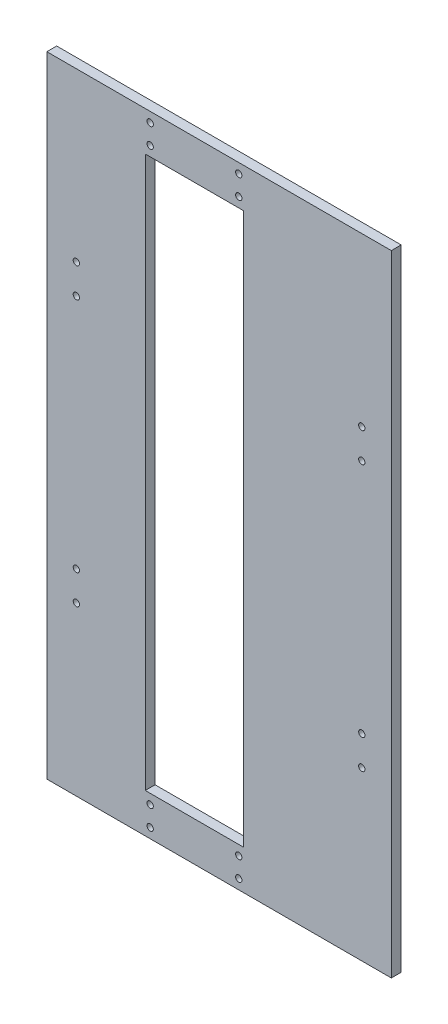
ISO-10303-21;
HEADER;
FILE_DESCRIPTION(('STEP AP214'),'2;1');
FILE_NAME('part.step','',(''),(''),'','','');
FILE_SCHEMA(('AUTOMOTIVE_DESIGN { 1 0 10303 214 1 1 1 1 }'));
ENDSEC;
DATA;
#1=APPLICATION_CONTEXT('core data for automotive mechanical design processes');
#2=APPLICATION_PROTOCOL_DEFINITION('international standard','automotive_design',2000,#1);
#3=PRODUCT_CONTEXT('',#1,'mechanical');
#4=PRODUCT('Part','Part','',(#3));
#5=PRODUCT_RELATED_PRODUCT_CATEGORY('part','',(#4));
#6=PRODUCT_DEFINITION_FORMATION('','',#4);
#7=PRODUCT_DEFINITION_CONTEXT('part definition',#1,'design');
#8=PRODUCT_DEFINITION('design','',#6,#7);
#9=PRODUCT_DEFINITION_SHAPE('','',#8);
#10=(LENGTH_UNIT() NAMED_UNIT(*) SI_UNIT(.MILLI.,.METRE.));
#11=(NAMED_UNIT(*) PLANE_ANGLE_UNIT() SI_UNIT($,.RADIAN.));
#12=(NAMED_UNIT(*) SI_UNIT($,.STERADIAN.) SOLID_ANGLE_UNIT());
#13=UNCERTAINTY_MEASURE_WITH_UNIT(LENGTH_MEASURE(1.E-05),#10,'distance_accuracy_value','');
#14=(GEOMETRIC_REPRESENTATION_CONTEXT(3) GLOBAL_UNCERTAINTY_ASSIGNED_CONTEXT((#13)) GLOBAL_UNIT_ASSIGNED_CONTEXT((#10,
#11,#12)) REPRESENTATION_CONTEXT('',''));
#15=CARTESIAN_POINT('',(0.,0.,0.));
#16=DIRECTION('',(0.,0.,1.));
#17=DIRECTION('',(1.,0.,0.));
#18=AXIS2_PLACEMENT_3D('',#15,#16,#17);
#19=CARTESIAN_POINT('',(0.,0.,5.));
#20=DIRECTION('',(0.,0.,-1.));
#21=DIRECTION('',(-1.,0.,0.));
#22=AXIS2_PLACEMENT_3D('',#19,#20,#21);
#23=PLANE('',#22);
#24=CARTESIAN_POINT('',(-60.,60.,5.));
#25=DIRECTION('',(0.,0.,1.));
#26=DIRECTION('',(1.,0.,0.));
#27=AXIS2_PLACEMENT_3D('',#24,#25,#26);
#28=CIRCLE('',#27,1.6);
#29=CARTESIAN_POINT('',(-58.4,60.,5.));
#30=VERTEX_POINT('',#29);
#31=EDGE_CURVE('E513',#30,#30,#28,.T.);
#32=ORIENTED_EDGE('',*,*,#31,.F.);
#33=EDGE_LOOP('',(#32));
#34=FACE_BOUND('',#33,.T.);
#35=CARTESIAN_POINT('',(-59.9999999999998,-60.,5.));
#36=DIRECTION('',(0.,0.,1.));
#37=DIRECTION('',(-1.,0.,0.));
#38=AXIS2_PLACEMENT_3D('',#35,#36,#37);
#39=CIRCLE('',#38,1.6);
#40=CARTESIAN_POINT('',(-61.5999999999998,-60.,5.));
#41=VERTEX_POINT('',#40);
#42=EDGE_CURVE('E516',#41,#41,#39,.T.);
#43=ORIENTED_EDGE('',*,*,#42,.F.);
#44=EDGE_LOOP('',(#43));
#45=FACE_BOUND('',#44,.T.);
#46=CARTESIAN_POINT('',(-59.9999999999998,-75.,5.));
#47=DIRECTION('',(0.,0.,1.));
#48=DIRECTION('',(-1.,0.,0.));
#49=AXIS2_PLACEMENT_3D('',#46,#47,#48);
#50=CIRCLE('',#49,1.6);
#51=CARTESIAN_POINT('',(-61.5999999999997,-75.,5.));
#52=VERTEX_POINT('',#51);
#53=EDGE_CURVE('E527',#52,#52,#50,.T.);
#54=ORIENTED_EDGE('',*,*,#53,.F.);
#55=EDGE_LOOP('',(#54));
#56=FACE_BOUND('',#55,.T.);
#57=CARTESIAN_POINT('',(84.9999999999997,-75.,5.));
#58=DIRECTION('',(0.,0.,1.));
#59=DIRECTION('',(1.,0.,0.));
#60=AXIS2_PLACEMENT_3D('',#57,#58,#59);
#61=CIRCLE('',#60,1.60000000000002);
#62=CARTESIAN_POINT('',(86.5999999999998,-75.,5.));
#63=VERTEX_POINT('',#62);
#64=EDGE_CURVE('E533',#63,#63,#61,.T.);
#65=ORIENTED_EDGE('',*,*,#64,.F.);
#66=EDGE_LOOP('',(#65));
#67=FACE_BOUND('',#66,.T.);
#68=CARTESIAN_POINT('',(84.9999999999998,-60.,5.));
#69=DIRECTION('',(0.,0.,1.));
#70=DIRECTION('',(1.,0.,0.));
#71=AXIS2_PLACEMENT_3D('',#68,#69,#70);
#72=CIRCLE('',#71,1.60000000000002);
#73=CARTESIAN_POINT('',(86.5999999999998,-60.,5.));
#74=VERTEX_POINT('',#73);
#75=EDGE_CURVE('E538',#74,#74,#72,.T.);
#76=ORIENTED_EDGE('',*,*,#75,.F.);
#77=EDGE_LOOP('',(#76));
#78=FACE_BOUND('',#77,.T.);
#79=CARTESIAN_POINT('',(85.,60.,5.));
#80=DIRECTION('',(0.,0.,1.));
#81=DIRECTION('',(-1.,0.,0.));
#82=AXIS2_PLACEMENT_3D('',#79,#80,#81);
#83=CIRCLE('',#82,1.60000000000002);
#84=CARTESIAN_POINT('',(83.4,60.,5.));
#85=VERTEX_POINT('',#84);
#86=EDGE_CURVE('E583',#85,#85,#83,.T.);
#87=ORIENTED_EDGE('',*,*,#86,.F.);
#88=EDGE_LOOP('',(#87));
#89=FACE_BOUND('',#88,.T.);
#90=CARTESIAN_POINT('',(85.,75.,5.));
#91=DIRECTION('',(0.,0.,1.));
#92=DIRECTION('',(-1.,0.,0.));
#93=AXIS2_PLACEMENT_3D('',#90,#91,#92);
#94=CIRCLE('',#93,1.60000000000002);
#95=CARTESIAN_POINT('',(83.4,75.,5.));
#96=VERTEX_POINT('',#95);
#97=EDGE_CURVE('E590',#96,#96,#94,.T.);
#98=ORIENTED_EDGE('',*,*,#97,.F.);
#99=EDGE_LOOP('',(#98));
#100=FACE_BOUND('',#99,.T.);
#101=CARTESIAN_POINT('',(-60.,75.,5.));
#102=DIRECTION('',(0.,0.,1.));
#103=DIRECTION('',(1.,0.,0.));
#104=AXIS2_PLACEMENT_3D('',#101,#102,#103);
#105=CIRCLE('',#104,1.6);
#106=CARTESIAN_POINT('',(-58.4,75.,5.));
#107=VERTEX_POINT('',#106);
#108=EDGE_CURVE('E127',#107,#107,#105,.T.);
#109=ORIENTED_EDGE('',*,*,#108,.F.);
#110=EDGE_LOOP('',(#109));
#111=FACE_BOUND('',#110,.T.);
#112=CARTESIAN_POINT('',(-22.4999999999968,-155.,5.));
#113=DIRECTION('',(0.,0.,1.));
#114=DIRECTION('',(1.,0.,0.));
#115=AXIS2_PLACEMENT_3D('',#112,#113,#114);
#116=CIRCLE('',#115,1.6);
#117=CARTESIAN_POINT('',(-20.8999999999968,-155.,5.));
#118=VERTEX_POINT('',#117);
#119=EDGE_CURVE('E167',#118,#118,#116,.T.);
#120=ORIENTED_EDGE('',*,*,#119,.F.);
#121=EDGE_LOOP('',(#120));
#122=FACE_BOUND('',#121,.T.);
#123=CARTESIAN_POINT('',(22.5000000000032,-155.,5.));
#124=DIRECTION('',(0.,0.,1.));
#125=DIRECTION('',(1.,0.,0.));
#126=AXIS2_PLACEMENT_3D('',#123,#124,#125);
#127=CIRCLE('',#126,1.6);
#128=CARTESIAN_POINT('',(24.1000000000032,-155.,5.));
#129=VERTEX_POINT('',#128);
#130=EDGE_CURVE('E173',#129,#129,#127,.T.);
#131=ORIENTED_EDGE('',*,*,#130,.F.);
#132=EDGE_LOOP('',(#131));
#133=FACE_BOUND('',#132,.T.);
#134=CARTESIAN_POINT('',(22.5,155.,5.));
#135=DIRECTION('',(0.,0.,1.));
#136=DIRECTION('',(1.,0.,0.));
#137=AXIS2_PLACEMENT_3D('',#134,#135,#136);
#138=CIRCLE('',#137,1.6);
#139=CARTESIAN_POINT('',(24.1,155.,5.));
#140=VERTEX_POINT('',#139);
#141=EDGE_CURVE('E179',#140,#140,#138,.T.);
#142=ORIENTED_EDGE('',*,*,#141,.F.);
#143=EDGE_LOOP('',(#142));
#144=FACE_BOUND('',#143,.T.);
#145=CARTESIAN_POINT('',(-22.499999999997,-145.,5.));
#146=DIRECTION('',(0.,0.,1.));
#147=DIRECTION('',(1.,0.,0.));
#148=AXIS2_PLACEMENT_3D('',#145,#146,#147);
#149=CIRCLE('',#148,1.6);
#150=CARTESIAN_POINT('',(-20.899999999997,-145.,5.));
#151=VERTEX_POINT('',#150);
#152=EDGE_CURVE('E185',#151,#151,#149,.T.);
#153=ORIENTED_EDGE('',*,*,#152,.F.);
#154=EDGE_LOOP('',(#153));
#155=FACE_BOUND('',#154,.T.);
#156=CARTESIAN_POINT('',(22.500000000003,-145.,5.));
#157=DIRECTION('',(0.,0.,1.));
#158=DIRECTION('',(1.,0.,0.));
#159=AXIS2_PLACEMENT_3D('',#156,#157,#158);
#160=CIRCLE('',#159,1.6);
#161=CARTESIAN_POINT('',(24.100000000003,-145.,5.));
#162=VERTEX_POINT('',#161);
#163=EDGE_CURVE('E191',#162,#162,#160,.T.);
#164=ORIENTED_EDGE('',*,*,#163,.F.);
#165=EDGE_LOOP('',(#164));
#166=FACE_BOUND('',#165,.T.);
#167=CARTESIAN_POINT('',(22.5,145.,5.));
#168=DIRECTION('',(0.,0.,1.));
#169=DIRECTION('',(1.,0.,0.));
#170=AXIS2_PLACEMENT_3D('',#167,#168,#169);
#171=CIRCLE('',#170,1.6);
#172=CARTESIAN_POINT('',(24.1,145.,5.));
#173=VERTEX_POINT('',#172);
#174=EDGE_CURVE('E197',#173,#173,#171,.T.);
#175=ORIENTED_EDGE('',*,*,#174,.F.);
#176=EDGE_LOOP('',(#175));
#177=FACE_BOUND('',#176,.T.);
#178=CARTESIAN_POINT('',(-22.5,155.,5.));
#179=DIRECTION('',(0.,0.,1.));
#180=DIRECTION('',(1.,0.,0.));
#181=AXIS2_PLACEMENT_3D('',#178,#179,#180);
#182=CIRCLE('',#181,1.6);
#183=CARTESIAN_POINT('',(-20.9,155.,5.));
#184=VERTEX_POINT('',#183);
#185=EDGE_CURVE('E203',#184,#184,#182,.T.);
#186=ORIENTED_EDGE('',*,*,#185,.F.);
#187=EDGE_LOOP('',(#186));
#188=FACE_BOUND('',#187,.T.);
#189=CARTESIAN_POINT('',(-22.5,145.,5.));
#190=DIRECTION('',(0.,0.,1.));
#191=DIRECTION('',(1.,0.,0.));
#192=AXIS2_PLACEMENT_3D('',#189,#190,#191);
#193=CIRCLE('',#192,1.6);
#194=CARTESIAN_POINT('',(-20.9,145.,5.));
#195=VERTEX_POINT('',#194);
#196=EDGE_CURVE('E209',#195,#195,#193,.T.);
#197=ORIENTED_EDGE('',*,*,#196,.F.);
#198=EDGE_LOOP('',(#197));
#199=FACE_BOUND('',#198,.T.);
#200=DIRECTION('',(-1.,0.,0.));
#201=VECTOR('',#200,1.);
#202=CARTESIAN_POINT('',(50.,160.,5.));
#203=LINE('',#202,#201);
#204=CARTESIAN_POINT('',(100.,160.,5.));
#205=VERTEX_POINT('',#204);
#206=CARTESIAN_POINT('',(-75.,160.,5.));
#207=VERTEX_POINT('',#206);
#208=EDGE_CURVE('E11',#205,#207,#203,.T.);
#209=ORIENTED_EDGE('',*,*,#208,.T.);
#210=DIRECTION('',(0.,-1.,0.));
#211=VECTOR('',#210,1.);
#212=CARTESIAN_POINT('',(-75.,-160.,5.));
#213=LINE('',#212,#211);
#214=CARTESIAN_POINT('',(-75.,-160.,5.));
#215=VERTEX_POINT('',#214);
#216=EDGE_CURVE('E106',#207,#215,#213,.T.);
#217=ORIENTED_EDGE('',*,*,#216,.T.);
#218=DIRECTION('',(1.,0.,0.));
#219=VECTOR('',#218,1.);
#220=CARTESIAN_POINT('',(50.,-160.,5.));
#221=LINE('',#220,#219);
#222=CARTESIAN_POINT('',(100.,-160.,5.));
#223=VERTEX_POINT('',#222);
#224=EDGE_CURVE('E44',#215,#223,#221,.T.);
#225=ORIENTED_EDGE('',*,*,#224,.T.);
#226=DIRECTION('',(0.,1.,0.));
#227=VECTOR('',#226,1.);
#228=CARTESIAN_POINT('',(100.,-160.,5.));
#229=LINE('',#228,#227);
#230=EDGE_CURVE('E109',#223,#205,#229,.T.);
#231=ORIENTED_EDGE('',*,*,#230,.T.);
#232=EDGE_LOOP('',(#209,#217,#225,#231));
#233=FACE_BOUND('',#232,.T.);
#234=DIRECTION('',(0.,-1.,0.));
#235=VECTOR('',#234,1.);
#236=CARTESIAN_POINT('',(-25.,-140.,5.));
#237=LINE('',#236,#235);
#238=CARTESIAN_POINT('',(-25.,140.,5.));
#239=VERTEX_POINT('',#238);
#240=CARTESIAN_POINT('',(-25.,-140.,5.));
#241=VERTEX_POINT('',#240);
#242=EDGE_CURVE('E141',#239,#241,#237,.T.);
#243=ORIENTED_EDGE('',*,*,#242,.F.);
#244=DIRECTION('',(-1.,0.,0.));
#245=VECTOR('',#244,1.);
#246=CARTESIAN_POINT('',(25.,140.,5.));
#247=LINE('',#246,#245);
#248=CARTESIAN_POINT('',(25.,140.,5.));
#249=VERTEX_POINT('',#248);
#250=EDGE_CURVE('E148',#249,#239,#247,.T.);
#251=ORIENTED_EDGE('',*,*,#250,.F.);
#252=DIRECTION('',(0.,1.,0.));
#253=VECTOR('',#252,1.);
#254=CARTESIAN_POINT('',(25.,-140.,5.));
#255=LINE('',#254,#253);
#256=CARTESIAN_POINT('',(25.,-140.,5.));
#257=VERTEX_POINT('',#256);
#258=EDGE_CURVE('E146',#257,#249,#255,.T.);
#259=ORIENTED_EDGE('',*,*,#258,.F.);
#260=DIRECTION('',(1.,0.,0.));
#261=VECTOR('',#260,1.);
#262=CARTESIAN_POINT('',(25.,-140.,5.));
#263=LINE('',#262,#261);
#264=EDGE_CURVE('E143',#241,#257,#263,.T.);
#265=ORIENTED_EDGE('',*,*,#264,.F.);
#266=EDGE_LOOP('',(#243,#251,#259,#265));
#267=FACE_BOUND('',#266,.T.);
#268=ADVANCED_FACE('F35',(#34,#45,#56,#67,#78,#89,#100,#111,#122,#133,#144,#155,#166,#177,#188,
#199,#233,#267),#23,.F.);
#269=CARTESIAN_POINT('',(0.,0.,0.));
#270=DIRECTION('',(0.,0.,-1.));
#271=DIRECTION('',(-1.,0.,0.));
#272=AXIS2_PLACEMENT_3D('',#269,#270,#271);
#273=PLANE('',#272);
#274=CARTESIAN_POINT('',(-60.,60.,0.));
#275=DIRECTION('',(0.,0.,-1.));
#276=DIRECTION('',(-1.,0.,0.));
#277=AXIS2_PLACEMENT_3D('',#274,#275,#276);
#278=CIRCLE('',#277,1.6);
#279=CARTESIAN_POINT('',(-61.6,60.,0.));
#280=VERTEX_POINT('',#279);
#281=EDGE_CURVE('E511',#280,#280,#278,.F.);
#282=ORIENTED_EDGE('',*,*,#281,.T.);
#283=EDGE_LOOP('',(#282));
#284=FACE_BOUND('',#283,.T.);
#285=CARTESIAN_POINT('',(-59.9999999999998,-60.,0.));
#286=DIRECTION('',(0.,0.,-1.));
#287=DIRECTION('',(-1.,0.,0.));
#288=AXIS2_PLACEMENT_3D('',#285,#286,#287);
#289=CIRCLE('',#288,1.6);
#290=CARTESIAN_POINT('',(-61.5999999999998,-60.,0.));
#291=VERTEX_POINT('',#290);
#292=EDGE_CURVE('E524',#291,#291,#289,.F.);
#293=ORIENTED_EDGE('',*,*,#292,.T.);
#294=EDGE_LOOP('',(#293));
#295=FACE_BOUND('',#294,.T.);
#296=CARTESIAN_POINT('',(-59.9999999999998,-75.,0.));
#297=DIRECTION('',(0.,0.,-1.));
#298=DIRECTION('',(-1.,0.,0.));
#299=AXIS2_PLACEMENT_3D('',#296,#297,#298);
#300=CIRCLE('',#299,1.6);
#301=CARTESIAN_POINT('',(-61.5999999999997,-75.,0.));
#302=VERTEX_POINT('',#301);
#303=EDGE_CURVE('E530',#302,#302,#300,.F.);
#304=ORIENTED_EDGE('',*,*,#303,.T.);
#305=EDGE_LOOP('',(#304));
#306=FACE_BOUND('',#305,.T.);
#307=CARTESIAN_POINT('',(84.9999999999997,-75.,0.));
#308=DIRECTION('',(0.,0.,-1.));
#309=DIRECTION('',(-1.,0.,0.));
#310=AXIS2_PLACEMENT_3D('',#307,#308,#309);
#311=CIRCLE('',#310,1.60000000000002);
#312=CARTESIAN_POINT('',(83.3999999999997,-75.,0.));
#313=VERTEX_POINT('',#312);
#314=EDGE_CURVE('E536',#313,#313,#311,.F.);
#315=ORIENTED_EDGE('',*,*,#314,.T.);
#316=EDGE_LOOP('',(#315));
#317=FACE_BOUND('',#316,.T.);
#318=CARTESIAN_POINT('',(84.9999999999998,-60.,0.));
#319=DIRECTION('',(0.,0.,-1.));
#320=DIRECTION('',(-1.,0.,0.));
#321=AXIS2_PLACEMENT_3D('',#318,#319,#320);
#322=CIRCLE('',#321,1.60000000000002);
#323=CARTESIAN_POINT('',(83.3999999999998,-60.,0.));
#324=VERTEX_POINT('',#323);
#325=EDGE_CURVE('E578',#324,#324,#322,.F.);
#326=ORIENTED_EDGE('',*,*,#325,.T.);
#327=EDGE_LOOP('',(#326));
#328=FACE_BOUND('',#327,.T.);
#329=CARTESIAN_POINT('',(85.,60.,0.));
#330=DIRECTION('',(0.,0.,-1.));
#331=DIRECTION('',(-1.,0.,0.));
#332=AXIS2_PLACEMENT_3D('',#329,#330,#331);
#333=CIRCLE('',#332,1.60000000000002);
#334=CARTESIAN_POINT('',(83.4,60.,0.));
#335=VERTEX_POINT('',#334);
#336=EDGE_CURVE('E588',#335,#335,#333,.F.);
#337=ORIENTED_EDGE('',*,*,#336,.T.);
#338=EDGE_LOOP('',(#337));
#339=FACE_BOUND('',#338,.T.);
#340=CARTESIAN_POINT('',(85.,75.,0.));
#341=DIRECTION('',(0.,0.,-1.));
#342=DIRECTION('',(-1.,0.,0.));
#343=AXIS2_PLACEMENT_3D('',#340,#341,#342);
#344=CIRCLE('',#343,1.60000000000002);
#345=CARTESIAN_POINT('',(83.4,75.,0.));
#346=VERTEX_POINT('',#345);
#347=EDGE_CURVE('E519',#346,#346,#344,.F.);
#348=ORIENTED_EDGE('',*,*,#347,.T.);
#349=EDGE_LOOP('',(#348));
#350=FACE_BOUND('',#349,.T.);
#351=CARTESIAN_POINT('',(-60.,75.,0.));
#352=DIRECTION('',(0.,0.,-1.));
#353=DIRECTION('',(-1.,0.,0.));
#354=AXIS2_PLACEMENT_3D('',#351,#352,#353);
#355=CIRCLE('',#354,1.6);
#356=CARTESIAN_POINT('',(-61.6,75.,0.));
#357=VERTEX_POINT('',#356);
#358=EDGE_CURVE('E130',#357,#357,#355,.F.);
#359=ORIENTED_EDGE('',*,*,#358,.T.);
#360=EDGE_LOOP('',(#359));
#361=FACE_BOUND('',#360,.T.);
#362=CARTESIAN_POINT('',(22.5000000000032,-155.,0.));
#363=DIRECTION('',(0.,0.,1.));
#364=DIRECTION('',(1.,0.,0.));
#365=AXIS2_PLACEMENT_3D('',#362,#363,#364);
#366=CIRCLE('',#365,1.6);
#367=CARTESIAN_POINT('',(24.1000000000032,-155.,0.));
#368=VERTEX_POINT('',#367);
#369=EDGE_CURVE('E170',#368,#368,#366,.T.);
#370=ORIENTED_EDGE('',*,*,#369,.T.);
#371=EDGE_LOOP('',(#370));
#372=FACE_BOUND('',#371,.T.);
#373=CARTESIAN_POINT('',(-22.499999999997,-145.,0.));
#374=DIRECTION('',(0.,0.,1.));
#375=DIRECTION('',(1.,0.,0.));
#376=AXIS2_PLACEMENT_3D('',#373,#374,#375);
#377=CIRCLE('',#376,1.6);
#378=CARTESIAN_POINT('',(-20.899999999997,-145.,0.));
#379=VERTEX_POINT('',#378);
#380=EDGE_CURVE('E182',#379,#379,#377,.T.);
#381=ORIENTED_EDGE('',*,*,#380,.T.);
#382=EDGE_LOOP('',(#381));
#383=FACE_BOUND('',#382,.T.);
#384=CARTESIAN_POINT('',(22.5,145.,0.));
#385=DIRECTION('',(0.,0.,1.));
#386=DIRECTION('',(1.,0.,0.));
#387=AXIS2_PLACEMENT_3D('',#384,#385,#386);
#388=CIRCLE('',#387,1.6);
#389=CARTESIAN_POINT('',(24.1,145.,0.));
#390=VERTEX_POINT('',#389);
#391=EDGE_CURVE('E194',#390,#390,#388,.T.);
#392=ORIENTED_EDGE('',*,*,#391,.T.);
#393=EDGE_LOOP('',(#392));
#394=FACE_BOUND('',#393,.T.);
#395=CARTESIAN_POINT('',(-22.5,145.,0.));
#396=DIRECTION('',(0.,0.,1.));
#397=DIRECTION('',(1.,0.,0.));
#398=AXIS2_PLACEMENT_3D('',#395,#396,#397);
#399=CIRCLE('',#398,1.6);
#400=CARTESIAN_POINT('',(-20.9,145.,0.));
#401=VERTEX_POINT('',#400);
#402=EDGE_CURVE('E206',#401,#401,#399,.T.);
#403=ORIENTED_EDGE('',*,*,#402,.T.);
#404=EDGE_LOOP('',(#403));
#405=FACE_BOUND('',#404,.T.);
#406=DIRECTION('',(1.,0.,0.));
#407=VECTOR('',#406,1.);
#408=CARTESIAN_POINT('',(50.,-160.,0.));
#409=LINE('',#408,#407);
#410=CARTESIAN_POINT('',(-75.,-160.,0.));
#411=VERTEX_POINT('',#410);
#412=CARTESIAN_POINT('',(100.,-160.,0.));
#413=VERTEX_POINT('',#412);
#414=EDGE_CURVE('E212',#411,#413,#409,.T.);
#415=ORIENTED_EDGE('',*,*,#414,.F.);
#416=DIRECTION('',(0.,-1.,0.));
#417=VECTOR('',#416,1.);
#418=CARTESIAN_POINT('',(-75.,-160.,0.));
#419=LINE('',#418,#417);
#420=CARTESIAN_POINT('',(-75.,160.,0.));
#421=VERTEX_POINT('',#420);
#422=EDGE_CURVE('E124',#421,#411,#419,.T.);
#423=ORIENTED_EDGE('',*,*,#422,.F.);
#424=DIRECTION('',(-1.,0.,0.));
#425=VECTOR('',#424,1.);
#426=CARTESIAN_POINT('',(50.,160.,0.));
#427=LINE('',#426,#425);
#428=CARTESIAN_POINT('',(100.,160.,0.));
#429=VERTEX_POINT('',#428);
#430=EDGE_CURVE('E39',#429,#421,#427,.T.);
#431=ORIENTED_EDGE('',*,*,#430,.F.);
#432=DIRECTION('',(0.,1.,0.));
#433=VECTOR('',#432,1.);
#434=CARTESIAN_POINT('',(100.,-160.,0.));
#435=LINE('',#434,#433);
#436=EDGE_CURVE('E119',#413,#429,#435,.T.);
#437=ORIENTED_EDGE('',*,*,#436,.F.);
#438=EDGE_LOOP('',(#415,#423,#431,#437));
#439=FACE_BOUND('',#438,.T.);
#440=CARTESIAN_POINT('',(-22.5,155.,0.));
#441=DIRECTION('',(0.,0.,1.));
#442=DIRECTION('',(1.,0.,0.));
#443=AXIS2_PLACEMENT_3D('',#440,#441,#442);
#444=CIRCLE('',#443,1.6);
#445=CARTESIAN_POINT('',(-20.9,155.,0.));
#446=VERTEX_POINT('',#445);
#447=EDGE_CURVE('E200',#446,#446,#444,.T.);
#448=ORIENTED_EDGE('',*,*,#447,.T.);
#449=EDGE_LOOP('',(#448));
#450=FACE_BOUND('',#449,.T.);
#451=CARTESIAN_POINT('',(22.500000000003,-145.,0.));
#452=DIRECTION('',(0.,0.,1.));
#453=DIRECTION('',(1.,0.,0.));
#454=AXIS2_PLACEMENT_3D('',#451,#452,#453);
#455=CIRCLE('',#454,1.6);
#456=CARTESIAN_POINT('',(24.100000000003,-145.,0.));
#457=VERTEX_POINT('',#456);
#458=EDGE_CURVE('E188',#457,#457,#455,.T.);
#459=ORIENTED_EDGE('',*,*,#458,.T.);
#460=EDGE_LOOP('',(#459));
#461=FACE_BOUND('',#460,.T.);
#462=CARTESIAN_POINT('',(22.5,155.,0.));
#463=DIRECTION('',(0.,0.,1.));
#464=DIRECTION('',(1.,0.,0.));
#465=AXIS2_PLACEMENT_3D('',#462,#463,#464);
#466=CIRCLE('',#465,1.6);
#467=CARTESIAN_POINT('',(24.1,155.,0.));
#468=VERTEX_POINT('',#467);
#469=EDGE_CURVE('E176',#468,#468,#466,.T.);
#470=ORIENTED_EDGE('',*,*,#469,.T.);
#471=EDGE_LOOP('',(#470));
#472=FACE_BOUND('',#471,.T.);
#473=CARTESIAN_POINT('',(-22.4999999999968,-155.,0.));
#474=DIRECTION('',(0.,0.,1.));
#475=DIRECTION('',(1.,0.,0.));
#476=AXIS2_PLACEMENT_3D('',#473,#474,#475);
#477=CIRCLE('',#476,1.6);
#478=CARTESIAN_POINT('',(-20.8999999999968,-155.,0.));
#479=VERTEX_POINT('',#478);
#480=EDGE_CURVE('E166',#479,#479,#477,.T.);
#481=ORIENTED_EDGE('',*,*,#480,.T.);
#482=EDGE_LOOP('',(#481));
#483=FACE_BOUND('',#482,.T.);
#484=DIRECTION('',(-1.,0.,0.));
#485=VECTOR('',#484,1.);
#486=CARTESIAN_POINT('',(25.,140.,0.));
#487=LINE('',#486,#485);
#488=CARTESIAN_POINT('',(25.,140.,0.));
#489=VERTEX_POINT('',#488);
#490=CARTESIAN_POINT('',(-25.,140.,0.));
#491=VERTEX_POINT('',#490);
#492=EDGE_CURVE('E144',#489,#491,#487,.T.);
#493=ORIENTED_EDGE('',*,*,#492,.T.);
#494=DIRECTION('',(0.,-1.,0.));
#495=VECTOR('',#494,1.);
#496=CARTESIAN_POINT('',(-25.,-140.,0.));
#497=LINE('',#496,#495);
#498=CARTESIAN_POINT('',(-25.,-140.,0.));
#499=VERTEX_POINT('',#498);
#500=EDGE_CURVE('E60',#491,#499,#497,.T.);
#501=ORIENTED_EDGE('',*,*,#500,.T.);
#502=DIRECTION('',(1.,0.,0.));
#503=VECTOR('',#502,1.);
#504=CARTESIAN_POINT('',(25.,-140.,0.));
#505=LINE('',#504,#503);
#506=CARTESIAN_POINT('',(25.,-140.,0.));
#507=VERTEX_POINT('',#506);
#508=EDGE_CURVE('E152',#499,#507,#505,.T.);
#509=ORIENTED_EDGE('',*,*,#508,.T.);
#510=DIRECTION('',(0.,1.,0.));
#511=VECTOR('',#510,1.);
#512=CARTESIAN_POINT('',(25.,-140.,0.));
#513=LINE('',#512,#511);
#514=EDGE_CURVE('E155',#507,#489,#513,.T.);
#515=ORIENTED_EDGE('',*,*,#514,.T.);
#516=EDGE_LOOP('',(#493,#501,#509,#515));
#517=FACE_BOUND('',#516,.T.);
#518=ADVANCED_FACE('F221',(#284,#295,#306,#317,#328,#339,#350,#361,#372,#383,#394,#405,#439,
#450,#461,#472,#483,#517),#273,.T.);
#519=CARTESIAN_POINT('',(50.,-160.,5.));
#520=DIRECTION('',(0.,1.,0.));
#521=DIRECTION('',(0.,0.,1.));
#522=AXIS2_PLACEMENT_3D('',#519,#520,#521);
#523=PLANE('',#522);
#524=ORIENTED_EDGE('',*,*,#414,.T.);
#525=DIRECTION('',(0.,0.,-1.));
#526=VECTOR('',#525,1.);
#527=CARTESIAN_POINT('',(100.,-160.,5.));
#528=LINE('',#527,#526);
#529=EDGE_CURVE('E138',#223,#413,#528,.T.);
#530=ORIENTED_EDGE('',*,*,#529,.F.);
#531=ORIENTED_EDGE('',*,*,#224,.F.);
#532=DIRECTION('',(0.,0.,-1.));
#533=VECTOR('',#532,1.);
#534=CARTESIAN_POINT('',(-75.,-160.,5.));
#535=LINE('',#534,#533);
#536=EDGE_CURVE('E120',#215,#411,#535,.T.);
#537=ORIENTED_EDGE('',*,*,#536,.T.);
#538=EDGE_LOOP('',(#524,#530,#531,#537));
#539=FACE_BOUND('',#538,.T.);
#540=ADVANCED_FACE('F37',(#539),#523,.F.);
#541=CARTESIAN_POINT('',(50.,160.,5.));
#542=DIRECTION('',(0.,-1.,0.));
#543=DIRECTION('',(0.,0.,-1.));
#544=AXIS2_PLACEMENT_3D('',#541,#542,#543);
#545=PLANE('',#544);
#546=ORIENTED_EDGE('',*,*,#430,.T.);
#547=DIRECTION('',(0.,0.,-1.));
#548=VECTOR('',#547,1.);
#549=CARTESIAN_POINT('',(-75.,160.,5.));
#550=LINE('',#549,#548);
#551=EDGE_CURVE('E114',#207,#421,#550,.T.);
#552=ORIENTED_EDGE('',*,*,#551,.F.);
#553=ORIENTED_EDGE('',*,*,#208,.F.);
#554=DIRECTION('',(0.,0.,-1.));
#555=VECTOR('',#554,1.);
#556=CARTESIAN_POINT('',(100.,160.,5.));
#557=LINE('',#556,#555);
#558=EDGE_CURVE('E134',#205,#429,#557,.T.);
#559=ORIENTED_EDGE('',*,*,#558,.T.);
#560=EDGE_LOOP('',(#546,#552,#553,#559));
#561=FACE_BOUND('',#560,.T.);
#562=ADVANCED_FACE('F115',(#561),#545,.F.);
#563=CARTESIAN_POINT('',(-22.5,145.,5.));
#564=DIRECTION('',(0.,0.,-1.));
#565=DIRECTION('',(-1.,0.,0.));
#566=AXIS2_PLACEMENT_3D('',#563,#564,#565);
#567=CYLINDRICAL_SURFACE('',#566,1.6);
#568=ORIENTED_EDGE('',*,*,#196,.T.);
#569=EDGE_LOOP('',(#568));
#570=FACE_BOUND('',#569,.T.);
#571=ORIENTED_EDGE('',*,*,#402,.F.);
#572=EDGE_LOOP('',(#571));
#573=FACE_BOUND('',#572,.T.);
#574=ADVANCED_FACE('F264',(#570,#573),#567,.F.);
#575=CARTESIAN_POINT('',(-22.5,155.,5.));
#576=DIRECTION('',(0.,0.,-1.));
#577=DIRECTION('',(-1.,0.,0.));
#578=AXIS2_PLACEMENT_3D('',#575,#576,#577);
#579=CYLINDRICAL_SURFACE('',#578,1.6);
#580=ORIENTED_EDGE('',*,*,#185,.T.);
#581=EDGE_LOOP('',(#580));
#582=FACE_BOUND('',#581,.T.);
#583=ORIENTED_EDGE('',*,*,#447,.F.);
#584=EDGE_LOOP('',(#583));
#585=FACE_BOUND('',#584,.T.);
#586=ADVANCED_FACE('F272',(#582,#585),#579,.F.);
#587=CARTESIAN_POINT('',(22.5,145.,5.));
#588=DIRECTION('',(0.,0.,-1.));
#589=DIRECTION('',(-1.,0.,0.));
#590=AXIS2_PLACEMENT_3D('',#587,#588,#589);
#591=CYLINDRICAL_SURFACE('',#590,1.6);
#592=ORIENTED_EDGE('',*,*,#174,.T.);
#593=EDGE_LOOP('',(#592));
#594=FACE_BOUND('',#593,.T.);
#595=ORIENTED_EDGE('',*,*,#391,.F.);
#596=EDGE_LOOP('',(#595));
#597=FACE_BOUND('',#596,.T.);
#598=ADVANCED_FACE('F367',(#594,#597),#591,.F.);
#599=CARTESIAN_POINT('',(22.500000000003,-145.,5.));
#600=DIRECTION('',(0.,0.,-1.));
#601=DIRECTION('',(-1.,0.,0.));
#602=AXIS2_PLACEMENT_3D('',#599,#600,#601);
#603=CYLINDRICAL_SURFACE('',#602,1.6);
#604=ORIENTED_EDGE('',*,*,#163,.T.);
#605=EDGE_LOOP('',(#604));
#606=FACE_BOUND('',#605,.T.);
#607=ORIENTED_EDGE('',*,*,#458,.F.);
#608=EDGE_LOOP('',(#607));
#609=FACE_BOUND('',#608,.T.);
#610=ADVANCED_FACE('F357',(#606,#609),#603,.F.);
#611=CARTESIAN_POINT('',(-22.499999999997,-145.,5.));
#612=DIRECTION('',(0.,0.,-1.));
#613=DIRECTION('',(-1.,0.,0.));
#614=AXIS2_PLACEMENT_3D('',#611,#612,#613);
#615=CYLINDRICAL_SURFACE('',#614,1.6);
#616=ORIENTED_EDGE('',*,*,#152,.T.);
#617=EDGE_LOOP('',(#616));
#618=FACE_BOUND('',#617,.T.);
#619=ORIENTED_EDGE('',*,*,#380,.F.);
#620=EDGE_LOOP('',(#619));
#621=FACE_BOUND('',#620,.T.);
#622=ADVANCED_FACE('F347',(#618,#621),#615,.F.);
#623=CARTESIAN_POINT('',(22.5,155.,5.));
#624=DIRECTION('',(0.,0.,-1.));
#625=DIRECTION('',(-1.,0.,0.));
#626=AXIS2_PLACEMENT_3D('',#623,#624,#625);
#627=CYLINDRICAL_SURFACE('',#626,1.6);
#628=ORIENTED_EDGE('',*,*,#141,.T.);
#629=EDGE_LOOP('',(#628));
#630=FACE_BOUND('',#629,.T.);
#631=ORIENTED_EDGE('',*,*,#469,.F.);
#632=EDGE_LOOP('',(#631));
#633=FACE_BOUND('',#632,.T.);
#634=ADVANCED_FACE('F337',(#630,#633),#627,.F.);
#635=CARTESIAN_POINT('',(22.5000000000032,-155.,5.));
#636=DIRECTION('',(0.,0.,-1.));
#637=DIRECTION('',(-1.,0.,0.));
#638=AXIS2_PLACEMENT_3D('',#635,#636,#637);
#639=CYLINDRICAL_SURFACE('',#638,1.6);
#640=ORIENTED_EDGE('',*,*,#130,.T.);
#641=EDGE_LOOP('',(#640));
#642=FACE_BOUND('',#641,.T.);
#643=ORIENTED_EDGE('',*,*,#369,.F.);
#644=EDGE_LOOP('',(#643));
#645=FACE_BOUND('',#644,.T.);
#646=ADVANCED_FACE('F327',(#642,#645),#639,.F.);
#647=CARTESIAN_POINT('',(-22.4999999999968,-155.,5.));
#648=DIRECTION('',(0.,0.,-1.));
#649=DIRECTION('',(-1.,0.,0.));
#650=AXIS2_PLACEMENT_3D('',#647,#648,#649);
#651=CYLINDRICAL_SURFACE('',#650,1.6);
#652=ORIENTED_EDGE('',*,*,#119,.T.);
#653=EDGE_LOOP('',(#652));
#654=FACE_BOUND('',#653,.T.);
#655=ORIENTED_EDGE('',*,*,#480,.F.);
#656=EDGE_LOOP('',(#655));
#657=FACE_BOUND('',#656,.T.);
#658=ADVANCED_FACE('F318',(#654,#657),#651,.F.);
#659=CARTESIAN_POINT('',(-25.,-140.,5.));
#660=DIRECTION('',(1.,0.,0.));
#661=DIRECTION('',(0.,0.,-1.));
#662=AXIS2_PLACEMENT_3D('',#659,#660,#661);
#663=PLANE('',#662);
#664=ORIENTED_EDGE('',*,*,#500,.F.);
#665=DIRECTION('',(0.,0.,-1.));
#666=VECTOR('',#665,1.);
#667=CARTESIAN_POINT('',(-25.,140.,5.));
#668=LINE('',#667,#666);
#669=EDGE_CURVE('E150',#239,#491,#668,.T.);
#670=ORIENTED_EDGE('',*,*,#669,.F.);
#671=ORIENTED_EDGE('',*,*,#242,.T.);
#672=DIRECTION('',(0.,0.,-1.));
#673=VECTOR('',#672,1.);
#674=CARTESIAN_POINT('',(-25.,-140.,5.));
#675=LINE('',#674,#673);
#676=EDGE_CURVE('E164',#241,#499,#675,.T.);
#677=ORIENTED_EDGE('',*,*,#676,.T.);
#678=EDGE_LOOP('',(#664,#670,#671,#677));
#679=FACE_BOUND('',#678,.T.);
#680=ADVANCED_FACE('F238',(#679),#663,.T.);
#681=CARTESIAN_POINT('',(25.,-140.,5.));
#682=DIRECTION('',(0.,1.,0.));
#683=DIRECTION('',(0.,0.,1.));
#684=AXIS2_PLACEMENT_3D('',#681,#682,#683);
#685=PLANE('',#684);
#686=ORIENTED_EDGE('',*,*,#508,.F.);
#687=ORIENTED_EDGE('',*,*,#676,.F.);
#688=ORIENTED_EDGE('',*,*,#264,.T.);
#689=DIRECTION('',(0.,0.,-1.));
#690=VECTOR('',#689,1.);
#691=CARTESIAN_POINT('',(25.,-140.,5.));
#692=LINE('',#691,#690);
#693=EDGE_CURVE('E162',#257,#507,#692,.T.);
#694=ORIENTED_EDGE('',*,*,#693,.T.);
#695=EDGE_LOOP('',(#686,#687,#688,#694));
#696=FACE_BOUND('',#695,.T.);
#697=ADVANCED_FACE('F244',(#696),#685,.T.);
#698=CARTESIAN_POINT('',(25.,-140.,5.));
#699=DIRECTION('',(-1.,0.,0.));
#700=DIRECTION('',(0.,0.,1.));
#701=AXIS2_PLACEMENT_3D('',#698,#699,#700);
#702=PLANE('',#701);
#703=ORIENTED_EDGE('',*,*,#514,.F.);
#704=ORIENTED_EDGE('',*,*,#693,.F.);
#705=ORIENTED_EDGE('',*,*,#258,.T.);
#706=DIRECTION('',(0.,0.,-1.));
#707=VECTOR('',#706,1.);
#708=CARTESIAN_POINT('',(25.,140.,5.));
#709=LINE('',#708,#707);
#710=EDGE_CURVE('E52',#249,#489,#709,.T.);
#711=ORIENTED_EDGE('',*,*,#710,.T.);
#712=EDGE_LOOP('',(#703,#704,#705,#711));
#713=FACE_BOUND('',#712,.T.);
#714=ADVANCED_FACE('F246',(#713),#702,.T.);
#715=CARTESIAN_POINT('',(25.,140.,5.));
#716=DIRECTION('',(0.,-1.,0.));
#717=DIRECTION('',(0.,0.,-1.));
#718=AXIS2_PLACEMENT_3D('',#715,#716,#717);
#719=PLANE('',#718);
#720=ORIENTED_EDGE('',*,*,#492,.F.);
#721=ORIENTED_EDGE('',*,*,#710,.F.);
#722=ORIENTED_EDGE('',*,*,#250,.T.);
#723=ORIENTED_EDGE('',*,*,#669,.T.);
#724=EDGE_LOOP('',(#720,#721,#722,#723));
#725=FACE_BOUND('',#724,.T.);
#726=ADVANCED_FACE('F235',(#725),#719,.T.);
#727=CARTESIAN_POINT('',(100.,-160.,5.));
#728=DIRECTION('',(-1.,0.,0.));
#729=DIRECTION('',(0.,0.,1.));
#730=AXIS2_PLACEMENT_3D('',#727,#728,#729);
#731=PLANE('',#730);
#732=ORIENTED_EDGE('',*,*,#436,.T.);
#733=ORIENTED_EDGE('',*,*,#558,.F.);
#734=ORIENTED_EDGE('',*,*,#230,.F.);
#735=ORIENTED_EDGE('',*,*,#529,.T.);
#736=EDGE_LOOP('',(#732,#733,#734,#735));
#737=FACE_BOUND('',#736,.T.);
#738=ADVANCED_FACE('F220',(#737),#731,.F.);
#739=CARTESIAN_POINT('',(-75.,-160.,5.));
#740=DIRECTION('',(1.,0.,0.));
#741=DIRECTION('',(0.,0.,-1.));
#742=AXIS2_PLACEMENT_3D('',#739,#740,#741);
#743=PLANE('',#742);
#744=ORIENTED_EDGE('',*,*,#422,.T.);
#745=ORIENTED_EDGE('',*,*,#536,.F.);
#746=ORIENTED_EDGE('',*,*,#216,.F.);
#747=ORIENTED_EDGE('',*,*,#551,.T.);
#748=EDGE_LOOP('',(#744,#745,#746,#747));
#749=FACE_BOUND('',#748,.T.);
#750=ADVANCED_FACE('F122',(#749),#743,.F.);
#751=CARTESIAN_POINT('',(-60.,75.,-0.00100000000000013));
#752=DIRECTION('',(0.,0.,1.));
#753=DIRECTION('',(1.,0.,0.));
#754=AXIS2_PLACEMENT_3D('',#751,#752,#753);
#755=CYLINDRICAL_SURFACE('',#754,1.6);
#756=ORIENTED_EDGE('',*,*,#358,.F.);
#757=EDGE_LOOP('',(#756));
#758=FACE_BOUND('',#757,.T.);
#759=ORIENTED_EDGE('',*,*,#108,.T.);
#760=EDGE_LOOP('',(#759));
#761=FACE_BOUND('',#760,.T.);
#762=ADVANCED_FACE('F427',(#758,#761),#755,.F.);
#763=CARTESIAN_POINT('',(85.,75.,-0.00100000000000013));
#764=DIRECTION('',(0.,0.,1.));
#765=DIRECTION('',(1.,0.,0.));
#766=AXIS2_PLACEMENT_3D('',#763,#764,#765);
#767=CYLINDRICAL_SURFACE('',#766,1.60000000000002);
#768=ORIENTED_EDGE('',*,*,#347,.F.);
#769=EDGE_LOOP('',(#768));
#770=FACE_BOUND('',#769,.T.);
#771=ORIENTED_EDGE('',*,*,#97,.T.);
#772=EDGE_LOOP('',(#771));
#773=FACE_BOUND('',#772,.T.);
#774=ADVANCED_FACE('F434',(#770,#773),#767,.F.);
#775=CARTESIAN_POINT('',(85.,60.,-0.00100000000000013));
#776=DIRECTION('',(0.,0.,1.));
#777=DIRECTION('',(1.,0.,0.));
#778=AXIS2_PLACEMENT_3D('',#775,#776,#777);
#779=CYLINDRICAL_SURFACE('',#778,1.60000000000002);
#780=ORIENTED_EDGE('',*,*,#336,.F.);
#781=EDGE_LOOP('',(#780));
#782=FACE_BOUND('',#781,.T.);
#783=ORIENTED_EDGE('',*,*,#86,.T.);
#784=EDGE_LOOP('',(#783));
#785=FACE_BOUND('',#784,.T.);
#786=ADVANCED_FACE('F443',(#782,#785),#779,.F.);
#787=CARTESIAN_POINT('',(84.9999999999998,-60.,-0.00100000000000013));
#788=DIRECTION('',(0.,0.,1.));
#789=DIRECTION('',(1.,0.,0.));
#790=AXIS2_PLACEMENT_3D('',#787,#788,#789);
#791=CYLINDRICAL_SURFACE('',#790,1.60000000000002);
#792=ORIENTED_EDGE('',*,*,#325,.F.);
#793=EDGE_LOOP('',(#792));
#794=FACE_BOUND('',#793,.T.);
#795=ORIENTED_EDGE('',*,*,#75,.T.);
#796=EDGE_LOOP('',(#795));
#797=FACE_BOUND('',#796,.T.);
#798=ADVANCED_FACE('F452',(#794,#797),#791,.F.);
#799=CARTESIAN_POINT('',(84.9999999999997,-75.,-0.00100000000000013));
#800=DIRECTION('',(0.,0.,1.));
#801=DIRECTION('',(1.,0.,0.));
#802=AXIS2_PLACEMENT_3D('',#799,#800,#801);
#803=CYLINDRICAL_SURFACE('',#802,1.60000000000002);
#804=ORIENTED_EDGE('',*,*,#314,.F.);
#805=EDGE_LOOP('',(#804));
#806=FACE_BOUND('',#805,.T.);
#807=ORIENTED_EDGE('',*,*,#64,.T.);
#808=EDGE_LOOP('',(#807));
#809=FACE_BOUND('',#808,.T.);
#810=ADVANCED_FACE('F461',(#806,#809),#803,.F.);
#811=CARTESIAN_POINT('',(-59.9999999999998,-75.,-0.00100000000000013));
#812=DIRECTION('',(0.,0.,1.));
#813=DIRECTION('',(1.,0.,0.));
#814=AXIS2_PLACEMENT_3D('',#811,#812,#813);
#815=CYLINDRICAL_SURFACE('',#814,1.6);
#816=ORIENTED_EDGE('',*,*,#303,.F.);
#817=EDGE_LOOP('',(#816));
#818=FACE_BOUND('',#817,.T.);
#819=ORIENTED_EDGE('',*,*,#53,.T.);
#820=EDGE_LOOP('',(#819));
#821=FACE_BOUND('',#820,.T.);
#822=ADVANCED_FACE('F470',(#818,#821),#815,.F.);
#823=CARTESIAN_POINT('',(-59.9999999999998,-60.,-0.00100000000000013));
#824=DIRECTION('',(0.,0.,1.));
#825=DIRECTION('',(1.,0.,0.));
#826=AXIS2_PLACEMENT_3D('',#823,#824,#825);
#827=CYLINDRICAL_SURFACE('',#826,1.6);
#828=ORIENTED_EDGE('',*,*,#292,.F.);
#829=EDGE_LOOP('',(#828));
#830=FACE_BOUND('',#829,.T.);
#831=ORIENTED_EDGE('',*,*,#42,.T.);
#832=EDGE_LOOP('',(#831));
#833=FACE_BOUND('',#832,.T.);
#834=ADVANCED_FACE('F479',(#830,#833),#827,.F.);
#835=CARTESIAN_POINT('',(-60.,60.,-0.00100000000000013));
#836=DIRECTION('',(0.,0.,1.));
#837=DIRECTION('',(1.,0.,0.));
#838=AXIS2_PLACEMENT_3D('',#835,#836,#837);
#839=CYLINDRICAL_SURFACE('',#838,1.6);
#840=ORIENTED_EDGE('',*,*,#281,.F.);
#841=EDGE_LOOP('',(#840));
#842=FACE_BOUND('',#841,.T.);
#843=ORIENTED_EDGE('',*,*,#31,.T.);
#844=EDGE_LOOP('',(#843));
#845=FACE_BOUND('',#844,.T.);
#846=ADVANCED_FACE('F488',(#842,#845),#839,.F.);
#847=CLOSED_SHELL('',(#268,#518,#540,#562,#574,#586,#598,#610,#622,#634,#646,#658,#680,#697,
#714,#726,#738,#750,#762,#774,#786,#798,#810,#822,#834,#846));
#848=MANIFOLD_SOLID_BREP('B2',#847);
#849=ADVANCED_BREP_SHAPE_REPRESENTATION('',(#18,#848),#14);
#850=SHAPE_DEFINITION_REPRESENTATION(#9,#849);
ENDSEC;
END-ISO-10303-21;
